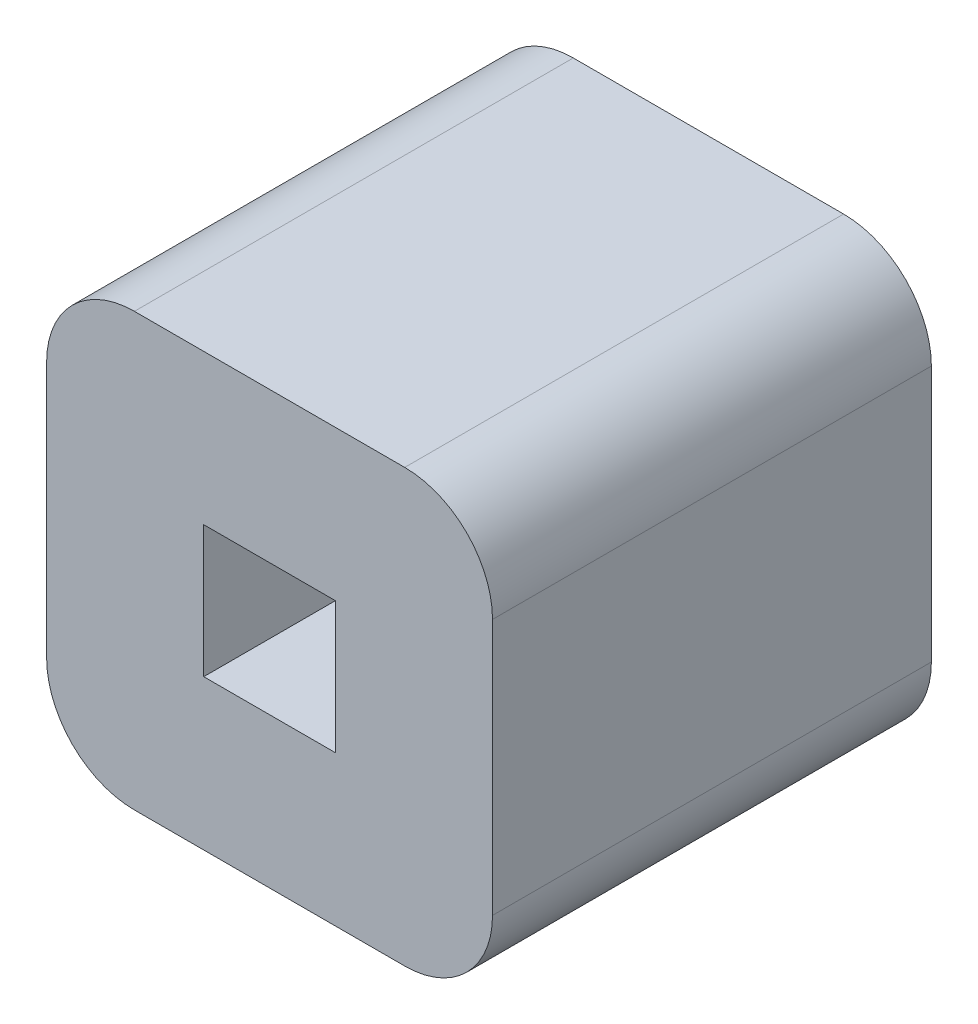
ISO-10303-21;
HEADER;
FILE_DESCRIPTION(('STEP AP214'),'2;1');
FILE_NAME('part.step','',(''),(''),'','','');
FILE_SCHEMA(('AUTOMOTIVE_DESIGN { 1 0 10303 214 1 1 1 1 }'));
ENDSEC;
DATA;
#1=APPLICATION_CONTEXT('core data for automotive mechanical design processes');
#2=APPLICATION_PROTOCOL_DEFINITION('international standard','automotive_design',2000,#1);
#3=PRODUCT_CONTEXT('',#1,'mechanical');
#4=PRODUCT('Part','Part','',(#3));
#5=PRODUCT_RELATED_PRODUCT_CATEGORY('part','',(#4));
#6=PRODUCT_DEFINITION_FORMATION('','',#4);
#7=PRODUCT_DEFINITION_CONTEXT('part definition',#1,'design');
#8=PRODUCT_DEFINITION('design','',#6,#7);
#9=PRODUCT_DEFINITION_SHAPE('','',#8);
#10=(LENGTH_UNIT() NAMED_UNIT(*) SI_UNIT(.MILLI.,.METRE.));
#11=(NAMED_UNIT(*) PLANE_ANGLE_UNIT() SI_UNIT($,.RADIAN.));
#12=(NAMED_UNIT(*) SI_UNIT($,.STERADIAN.) SOLID_ANGLE_UNIT());
#13=UNCERTAINTY_MEASURE_WITH_UNIT(LENGTH_MEASURE(1.E-05),#10,'distance_accuracy_value','');
#14=(GEOMETRIC_REPRESENTATION_CONTEXT(3) GLOBAL_UNCERTAINTY_ASSIGNED_CONTEXT((#13)) GLOBAL_UNIT_ASSIGNED_CONTEXT((#10,
#11,#12)) REPRESENTATION_CONTEXT('',''));
#15=CARTESIAN_POINT('',(0.,0.,0.));
#16=DIRECTION('',(0.,0.,1.));
#17=DIRECTION('',(1.,0.,0.));
#18=AXIS2_PLACEMENT_3D('',#15,#16,#17);
#19=CARTESIAN_POINT('',(0.960735714690616,-1.07588735959036,0.0649535433070866));
#20=DIRECTION('',(0.,0.,1.));
#21=DIRECTION('',(0.,-1.,0.));
#22=AXIS2_PLACEMENT_3D('',#19,#20,#21);
#23=PLANE('',#22);
#24=CARTESIAN_POINT('',(0.985420754060695,-0.888879485574608,0.0649535433070866));
#25=DIRECTION('',(0.,0.,1.));
#26=DIRECTION('',(0.,-1.,0.));
#27=AXIS2_PLACEMENT_3D('',#24,#25,#26);
#28=CIRCLE('',#27,0.0196850393700787);
#29=CARTESIAN_POINT('',(0.985420754060695,-0.869194446204529,0.0649535433070866));
#30=VERTEX_POINT('',#29);
#31=CARTESIAN_POINT('',(0.965735714690616,-0.888879485574608,0.0649535433070866));
#32=VERTEX_POINT('',#31);
#33=EDGE_CURVE('E131',#30,#32,#28,.T.);
#34=ORIENTED_EDGE('',*,*,#33,.F.);
#35=DIRECTION('',(1.,0.,0.));
#36=VECTOR('',#35,1.);
#37=CARTESIAN_POINT('',(0.982389257997702,-0.869194446204529,0.0649535433070866));
#38=LINE('',#37,#36);
#39=CARTESIAN_POINT('',(1.04605067532054,-0.869194446204529,0.0649535433070866));
#40=VERTEX_POINT('',#39);
#41=EDGE_CURVE('E128',#30,#40,#38,.T.);
#42=ORIENTED_EDGE('',*,*,#41,.T.);
#43=CARTESIAN_POINT('',(1.04605067532054,-0.888879485574608,0.0649535433070866));
#44=DIRECTION('',(0.,0.,1.));
#45=DIRECTION('',(0.,-1.,0.));
#46=AXIS2_PLACEMENT_3D('',#43,#44,#45);
#47=CIRCLE('',#46,0.0196850393700787);
#48=CARTESIAN_POINT('',(1.06573571469062,-0.888879485574608,0.0649535433070866));
#49=VERTEX_POINT('',#48);
#50=EDGE_CURVE('E139',#49,#40,#47,.T.);
#51=ORIENTED_EDGE('',*,*,#50,.F.);
#52=DIRECTION('',(0.,1.,0.));
#53=VECTOR('',#52,1.);
#54=CARTESIAN_POINT('',(1.06573571469062,-0.917619643054922,0.0649535433070866));
#55=LINE('',#54,#53);
#56=CARTESIAN_POINT('',(1.06573571469062,-0.946359800535237,0.0649535433070866));
#57=VERTEX_POINT('',#56);
#58=EDGE_CURVE('E136',#57,#49,#55,.T.);
#59=ORIENTED_EDGE('',*,*,#58,.F.);
#60=CARTESIAN_POINT('',(1.04605067532054,-0.946359800535237,0.0649535433070866));
#61=DIRECTION('',(0.,0.,-1.));
#62=DIRECTION('',(0.,1.,0.));
#63=AXIS2_PLACEMENT_3D('',#60,#61,#62);
#64=CIRCLE('',#63,0.0196850393700787);
#65=CARTESIAN_POINT('',(1.04605067532054,-0.966044839905316,0.0649535433070866));
#66=VERTEX_POINT('',#65);
#67=EDGE_CURVE('E162',#66,#57,#64,.F.);
#68=ORIENTED_EDGE('',*,*,#67,.F.);
#69=DIRECTION('',(1.,0.,0.));
#70=VECTOR('',#69,1.);
#71=CARTESIAN_POINT('',(0.982389257997702,-0.966044839905316,0.0649535433070866));
#72=LINE('',#71,#70);
#73=CARTESIAN_POINT('',(0.985420754060695,-0.966044839905316,0.0649535433070866));
#74=VERTEX_POINT('',#73);
#75=EDGE_CURVE('E141',#74,#66,#72,.T.);
#76=ORIENTED_EDGE('',*,*,#75,.F.);
#77=CARTESIAN_POINT('',(0.985420754060695,-0.946359800535237,0.0649535433070866));
#78=DIRECTION('',(0.,0.,-1.));
#79=DIRECTION('',(0.,1.,0.));
#80=AXIS2_PLACEMENT_3D('',#77,#78,#79);
#81=CIRCLE('',#80,0.0196850393700787);
#82=CARTESIAN_POINT('',(0.965735714690616,-0.946359800535237,0.0649535433070866));
#83=VERTEX_POINT('',#82);
#84=EDGE_CURVE('E20',#83,#74,#81,.F.);
#85=ORIENTED_EDGE('',*,*,#84,.F.);
#86=DIRECTION('',(0.,-1.,0.));
#87=VECTOR('',#86,1.);
#88=CARTESIAN_POINT('',(0.965735714690616,-0.917619643054922,0.0649535433070866));
#89=LINE('',#88,#87);
#90=EDGE_CURVE('E133',#32,#83,#89,.T.);
#91=ORIENTED_EDGE('',*,*,#90,.F.);
#92=EDGE_LOOP('',(#34,#42,#51,#59,#68,#76,#85,#91));
#93=FACE_BOUND('',#92,.T.);
#94=DIRECTION('',(0.,-1.,0.));
#95=VECTOR('',#94,1.);
#96=CARTESIAN_POINT('',(1.00097193516306,-0.901379485574607,0.0649535433070866));
#97=LINE('',#96,#95);
#98=CARTESIAN_POINT('',(1.00097193516306,-0.902855863527363,0.0649535433070866));
#99=VERTEX_POINT('',#98);
#100=CARTESIAN_POINT('',(1.00097193516306,-0.932383422582481,0.0649535433070866));
#101=VERTEX_POINT('',#100);
#102=EDGE_CURVE('E135',#99,#101,#97,.T.);
#103=ORIENTED_EDGE('',*,*,#102,.T.);
#104=DIRECTION('',(1.,0.,0.));
#105=VECTOR('',#104,1.);
#106=CARTESIAN_POINT('',(1.03197587217093,-0.932383422582481,0.0649535433070866));
#107=LINE('',#106,#105);
#108=CARTESIAN_POINT('',(1.03049949421818,-0.932383422582481,0.0649535433070866));
#109=VERTEX_POINT('',#108);
#110=EDGE_CURVE('E103',#109,#101,#107,.F.);
#111=ORIENTED_EDGE('',*,*,#110,.F.);
#112=DIRECTION('',(0.,1.,0.));
#113=VECTOR('',#112,1.);
#114=CARTESIAN_POINT('',(1.03049949421818,-0.933859800535237,0.0649535433070866));
#115=LINE('',#114,#113);
#116=CARTESIAN_POINT('',(1.03049949421818,-0.902855863527363,0.0649535433070866));
#117=VERTEX_POINT('',#116);
#118=EDGE_CURVE('E116',#109,#117,#115,.T.);
#119=ORIENTED_EDGE('',*,*,#118,.T.);
#120=DIRECTION('',(1.,0.,0.));
#121=VECTOR('',#120,1.);
#122=CARTESIAN_POINT('',(1.03197587217093,-0.902855863527363,0.0649535433070866));
#123=LINE('',#122,#121);
#124=EDGE_CURVE('E94',#117,#99,#123,.F.);
#125=ORIENTED_EDGE('',*,*,#124,.T.);
#126=EDGE_LOOP('',(#103,#111,#119,#125));
#127=FACE_BOUND('',#126,.T.);
#128=ADVANCED_FACE('F17',(#93,#127),#23,.F.);
#129=CARTESIAN_POINT('',(1.03197587217093,-0.902855863527363,0.152158267716535));
#130=DIRECTION('',(0.,1.,0.));
#131=DIRECTION('',(0.,0.,1.));
#132=AXIS2_PLACEMENT_3D('',#129,#130,#131);
#133=PLANE('',#132);
#134=DIRECTION('',(0.,0.,1.));
#135=VECTOR('',#134,1.);
#136=CARTESIAN_POINT('',(1.03049949421818,-0.902855863527363,0.152158267716535));
#137=LINE('',#136,#135);
#138=CARTESIAN_POINT('',(1.03049949421818,-0.902855863527363,0.16337874015748));
#139=VERTEX_POINT('',#138);
#140=EDGE_CURVE('E110',#117,#139,#137,.T.);
#141=ORIENTED_EDGE('',*,*,#140,.T.);
#142=DIRECTION('',(1.,0.,0.));
#143=VECTOR('',#142,1.);
#144=CARTESIAN_POINT('',(0.960735714690616,-0.902855863527363,0.16337874015748));
#145=LINE('',#144,#143);
#146=CARTESIAN_POINT('',(1.00097193516306,-0.902855863527363,0.16337874015748));
#147=VERTEX_POINT('',#146);
#148=EDGE_CURVE('E199',#147,#139,#145,.T.);
#149=ORIENTED_EDGE('',*,*,#148,.F.);
#150=DIRECTION('',(0.,0.,1.));
#151=VECTOR('',#150,1.);
#152=CARTESIAN_POINT('',(1.00097193516306,-0.902855863527363,0.152158267716535));
#153=LINE('',#152,#151);
#154=EDGE_CURVE('E113',#147,#99,#153,.F.);
#155=ORIENTED_EDGE('',*,*,#154,.T.);
#156=ORIENTED_EDGE('',*,*,#124,.F.);
#157=EDGE_LOOP('',(#141,#149,#155,#156));
#158=FACE_BOUND('',#157,.T.);
#159=ADVANCED_FACE('F107',(#158),#133,.F.);
#160=CARTESIAN_POINT('',(1.03049949421818,-0.933859800535237,0.152158267716535));
#161=DIRECTION('',(1.,0.,0.));
#162=DIRECTION('',(0.,1.,0.));
#163=AXIS2_PLACEMENT_3D('',#160,#161,#162);
#164=PLANE('',#163);
#165=DIRECTION('',(0.,0.,1.));
#166=VECTOR('',#165,1.);
#167=CARTESIAN_POINT('',(1.03049949421818,-0.932383422582481,0.152158267716535));
#168=LINE('',#167,#166);
#169=CARTESIAN_POINT('',(1.03049949421818,-0.932383422582481,0.16337874015748));
#170=VERTEX_POINT('',#169);
#171=EDGE_CURVE('E181',#170,#109,#168,.F.);
#172=ORIENTED_EDGE('',*,*,#171,.F.);
#173=DIRECTION('',(0.,-1.,0.));
#174=VECTOR('',#173,1.);
#175=CARTESIAN_POINT('',(1.03049949421818,-1.07588735959036,0.16337874015748));
#176=LINE('',#175,#174);
#177=EDGE_CURVE('E123',#139,#170,#176,.T.);
#178=ORIENTED_EDGE('',*,*,#177,.F.);
#179=ORIENTED_EDGE('',*,*,#140,.F.);
#180=ORIENTED_EDGE('',*,*,#118,.F.);
#181=EDGE_LOOP('',(#172,#178,#179,#180));
#182=FACE_BOUND('',#181,.T.);
#183=ADVANCED_FACE('F121',(#182),#164,.F.);
#184=CARTESIAN_POINT('',(1.03197587217093,-0.932383422582481,0.152158267716535));
#185=DIRECTION('',(0.,1.,0.));
#186=DIRECTION('',(0.,0.,1.));
#187=AXIS2_PLACEMENT_3D('',#184,#185,#186);
#188=PLANE('',#187);
#189=DIRECTION('',(1.,0.,0.));
#190=VECTOR('',#189,1.);
#191=CARTESIAN_POINT('',(0.960735714690616,-0.932383422582481,0.16337874015748));
#192=LINE('',#191,#190);
#193=CARTESIAN_POINT('',(1.00097193516306,-0.932383422582481,0.16337874015748));
#194=VERTEX_POINT('',#193);
#195=EDGE_CURVE('E195',#170,#194,#192,.F.);
#196=ORIENTED_EDGE('',*,*,#195,.F.);
#197=ORIENTED_EDGE('',*,*,#171,.T.);
#198=ORIENTED_EDGE('',*,*,#110,.T.);
#199=DIRECTION('',(0.,0.,1.));
#200=VECTOR('',#199,1.);
#201=CARTESIAN_POINT('',(1.00097193516306,-0.932383422582481,0.152158267716535));
#202=LINE('',#201,#200);
#203=EDGE_CURVE('E178',#101,#194,#202,.T.);
#204=ORIENTED_EDGE('',*,*,#203,.T.);
#205=EDGE_LOOP('',(#196,#197,#198,#204));
#206=FACE_BOUND('',#205,.T.);
#207=ADVANCED_FACE('F184',(#206),#188,.T.);
#208=CARTESIAN_POINT('',(1.00097193516306,-0.901379485574607,0.152158267716535));
#209=DIRECTION('',(-1.,0.,0.));
#210=DIRECTION('',(0.,-1.,0.));
#211=AXIS2_PLACEMENT_3D('',#208,#209,#210);
#212=PLANE('',#211);
#213=ORIENTED_EDGE('',*,*,#154,.F.);
#214=DIRECTION('',(0.,-1.,0.));
#215=VECTOR('',#214,1.);
#216=CARTESIAN_POINT('',(1.00097193516306,-1.07588735959036,0.16337874015748));
#217=LINE('',#216,#215);
#218=EDGE_CURVE('E190',#194,#147,#217,.F.);
#219=ORIENTED_EDGE('',*,*,#218,.F.);
#220=ORIENTED_EDGE('',*,*,#203,.F.);
#221=ORIENTED_EDGE('',*,*,#102,.F.);
#222=EDGE_LOOP('',(#213,#219,#220,#221));
#223=FACE_BOUND('',#222,.T.);
#224=ADVANCED_FACE('F188',(#223),#212,.F.);
#225=CARTESIAN_POINT('',(0.965735714690616,-0.917619643054922,0.114166141732283));
#226=DIRECTION('',(-1.,0.,0.));
#227=DIRECTION('',(0.,-1.,0.));
#228=AXIS2_PLACEMENT_3D('',#225,#226,#227);
#229=PLANE('',#228);
#230=DIRECTION('',(0.,-1.,0.));
#231=VECTOR('',#230,1.);
#232=CARTESIAN_POINT('',(0.965735714690616,-1.07588735959036,0.16337874015748));
#233=LINE('',#232,#231);
#234=CARTESIAN_POINT('',(0.965735714690616,-0.888879485574608,0.16337874015748));
#235=VERTEX_POINT('',#234);
#236=CARTESIAN_POINT('',(0.965735714690616,-0.946359800535237,0.16337874015748));
#237=VERTEX_POINT('',#236);
#238=EDGE_CURVE('E157',#235,#237,#233,.T.);
#239=ORIENTED_EDGE('',*,*,#238,.F.);
#240=DIRECTION('',(0.,0.,1.));
#241=VECTOR('',#240,1.);
#242=CARTESIAN_POINT('',(0.965735714690616,-0.888879485574608,0.1683));
#243=LINE('',#242,#241);
#244=EDGE_CURVE('E160',#32,#235,#243,.T.);
#245=ORIENTED_EDGE('',*,*,#244,.F.);
#246=ORIENTED_EDGE('',*,*,#90,.T.);
#247=DIRECTION('',(0.,0.,-1.));
#248=VECTOR('',#247,1.);
#249=CARTESIAN_POINT('',(0.965735714690616,-0.946359800535237,0.1683));
#250=LINE('',#249,#248);
#251=EDGE_CURVE('E144',#237,#83,#250,.T.);
#252=ORIENTED_EDGE('',*,*,#251,.F.);
#253=EDGE_LOOP('',(#239,#245,#246,#252));
#254=FACE_BOUND('',#253,.T.);
#255=ADVANCED_FACE('F226',(#254),#229,.T.);
#256=CARTESIAN_POINT('',(0.985420754060695,-0.946359800535237,0.1683));
#257=DIRECTION('',(0.,0.,-1.));
#258=DIRECTION('',(0.,1.,0.));
#259=AXIS2_PLACEMENT_3D('',#256,#257,#258);
#260=CYLINDRICAL_SURFACE('',#259,0.0196850393700787);
#261=CARTESIAN_POINT('',(0.985420754060695,-0.946359800535237,0.16337874015748));
#262=DIRECTION('',(0.,0.,-1.));
#263=DIRECTION('',(0.,1.,0.));
#264=AXIS2_PLACEMENT_3D('',#261,#262,#263);
#265=CIRCLE('',#264,0.0196850393700787);
#266=CARTESIAN_POINT('',(0.985420754060695,-0.966044839905316,0.16337874015748));
#267=VERTEX_POINT('',#266);
#268=EDGE_CURVE('E154',#237,#267,#265,.F.);
#269=ORIENTED_EDGE('',*,*,#268,.F.);
#270=ORIENTED_EDGE('',*,*,#251,.T.);
#271=ORIENTED_EDGE('',*,*,#84,.T.);
#272=DIRECTION('',(0.,0.,-1.));
#273=VECTOR('',#272,1.);
#274=CARTESIAN_POINT('',(0.985420754060695,-0.966044839905316,0.0600322834645669));
#275=LINE('',#274,#273);
#276=EDGE_CURVE('E143',#267,#74,#275,.T.);
#277=ORIENTED_EDGE('',*,*,#276,.F.);
#278=EDGE_LOOP('',(#269,#270,#271,#277));
#279=FACE_BOUND('',#278,.T.);
#280=ADVANCED_FACE('F236',(#279),#260,.T.);
#281=CARTESIAN_POINT('',(0.982389257997702,-0.966044839905316,0.0600322834645669));
#282=DIRECTION('',(0.,-1.,0.));
#283=DIRECTION('',(0.,0.,-1.));
#284=AXIS2_PLACEMENT_3D('',#281,#282,#283);
#285=PLANE('',#284);
#286=DIRECTION('',(1.,0.,0.));
#287=VECTOR('',#286,1.);
#288=CARTESIAN_POINT('',(0.960735714690616,-0.966044839905316,0.16337874015748));
#289=LINE('',#288,#287);
#290=CARTESIAN_POINT('',(1.04605067532054,-0.966044839905316,0.16337874015748));
#291=VERTEX_POINT('',#290);
#292=EDGE_CURVE('E153',#267,#291,#289,.T.);
#293=ORIENTED_EDGE('',*,*,#292,.F.);
#294=ORIENTED_EDGE('',*,*,#276,.T.);
#295=ORIENTED_EDGE('',*,*,#75,.T.);
#296=DIRECTION('',(0.,0.,-1.));
#297=VECTOR('',#296,1.);
#298=CARTESIAN_POINT('',(1.04605067532054,-0.966044839905316,0.1683));
#299=LINE('',#298,#297);
#300=EDGE_CURVE('E163',#291,#66,#299,.T.);
#301=ORIENTED_EDGE('',*,*,#300,.F.);
#302=EDGE_LOOP('',(#293,#294,#295,#301));
#303=FACE_BOUND('',#302,.T.);
#304=ADVANCED_FACE('F234',(#303),#285,.T.);
#305=CARTESIAN_POINT('',(1.04605067532054,-0.946359800535237,0.1683));
#306=DIRECTION('',(0.,0.,-1.));
#307=DIRECTION('',(0.,1.,0.));
#308=AXIS2_PLACEMENT_3D('',#305,#306,#307);
#309=CYLINDRICAL_SURFACE('',#308,0.0196850393700787);
#310=CARTESIAN_POINT('',(1.04605067532054,-0.946359800535237,0.16337874015748));
#311=DIRECTION('',(0.,0.,-1.));
#312=DIRECTION('',(0.,1.,0.));
#313=AXIS2_PLACEMENT_3D('',#310,#311,#312);
#314=CIRCLE('',#313,0.0196850393700787);
#315=CARTESIAN_POINT('',(1.06573571469062,-0.946359800535237,0.16337874015748));
#316=VERTEX_POINT('',#315);
#317=EDGE_CURVE('E150',#291,#316,#314,.F.);
#318=ORIENTED_EDGE('',*,*,#317,.F.);
#319=ORIENTED_EDGE('',*,*,#300,.T.);
#320=ORIENTED_EDGE('',*,*,#67,.T.);
#321=DIRECTION('',(0.,0.,1.));
#322=VECTOR('',#321,1.);
#323=CARTESIAN_POINT('',(1.06573571469062,-0.946359800535237,0.114166141732283));
#324=LINE('',#323,#322);
#325=EDGE_CURVE('E140',#316,#57,#324,.F.);
#326=ORIENTED_EDGE('',*,*,#325,.F.);
#327=EDGE_LOOP('',(#318,#319,#320,#326));
#328=FACE_BOUND('',#327,.T.);
#329=ADVANCED_FACE('F215',(#328),#309,.T.);
#330=CARTESIAN_POINT('',(1.06573571469062,-0.917619643054922,0.114166141732283));
#331=DIRECTION('',(1.,0.,0.));
#332=DIRECTION('',(0.,1.,0.));
#333=AXIS2_PLACEMENT_3D('',#330,#331,#332);
#334=PLANE('',#333);
#335=ORIENTED_EDGE('',*,*,#325,.T.);
#336=ORIENTED_EDGE('',*,*,#58,.T.);
#337=DIRECTION('',(0.,0.,1.));
#338=VECTOR('',#337,1.);
#339=CARTESIAN_POINT('',(1.06573571469062,-0.888879485574608,0.1683));
#340=LINE('',#339,#338);
#341=CARTESIAN_POINT('',(1.06573571469062,-0.888879485574608,0.16337874015748));
#342=VERTEX_POINT('',#341);
#343=EDGE_CURVE('E161',#342,#49,#340,.F.);
#344=ORIENTED_EDGE('',*,*,#343,.F.);
#345=DIRECTION('',(0.,-1.,0.));
#346=VECTOR('',#345,1.);
#347=CARTESIAN_POINT('',(1.06573571469062,-1.07588735959036,0.16337874015748));
#348=LINE('',#347,#346);
#349=EDGE_CURVE('E149',#316,#342,#348,.F.);
#350=ORIENTED_EDGE('',*,*,#349,.F.);
#351=EDGE_LOOP('',(#335,#336,#344,#350));
#352=FACE_BOUND('',#351,.T.);
#353=ADVANCED_FACE('F212',(#352),#334,.T.);
#354=CARTESIAN_POINT('',(1.04605067532054,-0.888879485574608,0.1683));
#355=DIRECTION('',(0.,0.,1.));
#356=DIRECTION('',(0.,-1.,0.));
#357=AXIS2_PLACEMENT_3D('',#354,#355,#356);
#358=CYLINDRICAL_SURFACE('',#357,0.0196850393700787);
#359=CARTESIAN_POINT('',(1.04605067532054,-0.888879485574608,0.16337874015748));
#360=DIRECTION('',(0.,0.,1.));
#361=DIRECTION('',(0.,-1.,0.));
#362=AXIS2_PLACEMENT_3D('',#359,#360,#361);
#363=CIRCLE('',#362,0.0196850393700787);
#364=CARTESIAN_POINT('',(1.04605067532054,-0.869194446204529,0.16337874015748));
#365=VERTEX_POINT('',#364);
#366=EDGE_CURVE('E146',#342,#365,#363,.T.);
#367=ORIENTED_EDGE('',*,*,#366,.F.);
#368=ORIENTED_EDGE('',*,*,#343,.T.);
#369=ORIENTED_EDGE('',*,*,#50,.T.);
#370=DIRECTION('',(0.,0.,-1.));
#371=VECTOR('',#370,1.);
#372=CARTESIAN_POINT('',(1.04605067532054,-0.869194446204529,0.0600322834645669));
#373=LINE('',#372,#371);
#374=EDGE_CURVE('E132',#40,#365,#373,.F.);
#375=ORIENTED_EDGE('',*,*,#374,.T.);
#376=EDGE_LOOP('',(#367,#368,#369,#375));
#377=FACE_BOUND('',#376,.T.);
#378=ADVANCED_FACE('F233',(#377),#358,.T.);
#379=CARTESIAN_POINT('',(0.982389257997702,-0.869194446204529,0.0600322834645669));
#380=DIRECTION('',(0.,-1.,0.));
#381=DIRECTION('',(0.,0.,-1.));
#382=AXIS2_PLACEMENT_3D('',#379,#380,#381);
#383=PLANE('',#382);
#384=DIRECTION('',(0.,0.,1.));
#385=VECTOR('',#384,1.);
#386=CARTESIAN_POINT('',(0.985420754060695,-0.869194446204529,0.1683));
#387=LINE('',#386,#385);
#388=CARTESIAN_POINT('',(0.985420754060695,-0.869194446204529,0.16337874015748));
#389=VERTEX_POINT('',#388);
#390=EDGE_CURVE('E35',#389,#30,#387,.F.);
#391=ORIENTED_EDGE('',*,*,#390,.F.);
#392=DIRECTION('',(1.,0.,0.));
#393=VECTOR('',#392,1.);
#394=CARTESIAN_POINT('',(0.960735714690616,-0.869194446204529,0.16337874015748));
#395=LINE('',#394,#393);
#396=EDGE_CURVE('E26',#365,#389,#395,.F.);
#397=ORIENTED_EDGE('',*,*,#396,.F.);
#398=ORIENTED_EDGE('',*,*,#374,.F.);
#399=ORIENTED_EDGE('',*,*,#41,.F.);
#400=EDGE_LOOP('',(#391,#397,#398,#399));
#401=FACE_BOUND('',#400,.T.);
#402=ADVANCED_FACE('F230',(#401),#383,.F.);
#403=CARTESIAN_POINT('',(0.985420754060695,-0.888879485574608,0.1683));
#404=DIRECTION('',(0.,0.,1.));
#405=DIRECTION('',(0.,-1.,0.));
#406=AXIS2_PLACEMENT_3D('',#403,#404,#405);
#407=CYLINDRICAL_SURFACE('',#406,0.0196850393700787);
#408=CARTESIAN_POINT('',(0.985420754060695,-0.888879485574608,0.16337874015748));
#409=DIRECTION('',(0.,0.,1.));
#410=DIRECTION('',(0.,-1.,0.));
#411=AXIS2_PLACEMENT_3D('',#408,#409,#410);
#412=CIRCLE('',#411,0.0196850393700787);
#413=EDGE_CURVE('E11',#389,#235,#412,.T.);
#414=ORIENTED_EDGE('',*,*,#413,.F.);
#415=ORIENTED_EDGE('',*,*,#390,.T.);
#416=ORIENTED_EDGE('',*,*,#33,.T.);
#417=ORIENTED_EDGE('',*,*,#244,.T.);
#418=EDGE_LOOP('',(#414,#415,#416,#417));
#419=FACE_BOUND('',#418,.T.);
#420=ADVANCED_FACE('F228',(#419),#407,.T.);
#421=CARTESIAN_POINT('',(0.960735714690616,-1.07588735959036,0.16337874015748));
#422=DIRECTION('',(0.,0.,1.));
#423=DIRECTION('',(0.,-1.,0.));
#424=AXIS2_PLACEMENT_3D('',#421,#422,#423);
#425=PLANE('',#424);
#426=ORIENTED_EDGE('',*,*,#396,.T.);
#427=ORIENTED_EDGE('',*,*,#413,.T.);
#428=ORIENTED_EDGE('',*,*,#238,.T.);
#429=ORIENTED_EDGE('',*,*,#268,.T.);
#430=ORIENTED_EDGE('',*,*,#292,.T.);
#431=ORIENTED_EDGE('',*,*,#317,.T.);
#432=ORIENTED_EDGE('',*,*,#349,.T.);
#433=ORIENTED_EDGE('',*,*,#366,.T.);
#434=EDGE_LOOP('',(#426,#427,#428,#429,#430,#431,#432,#433));
#435=FACE_BOUND('',#434,.T.);
#436=ORIENTED_EDGE('',*,*,#195,.T.);
#437=ORIENTED_EDGE('',*,*,#218,.T.);
#438=ORIENTED_EDGE('',*,*,#148,.T.);
#439=ORIENTED_EDGE('',*,*,#177,.T.);
#440=EDGE_LOOP('',(#436,#437,#438,#439));
#441=FACE_BOUND('',#440,.T.);
#442=ADVANCED_FACE('F197',(#435,#441),#425,.T.);
#443=CLOSED_SHELL('',(#128,#159,#183,#207,#224,#255,#280,#304,#329,#353,#378,#402,#420,#442));
#444=MANIFOLD_SOLID_BREP('B1',#443);
#445=ADVANCED_BREP_SHAPE_REPRESENTATION('',(#18,#444),#14);
#446=SHAPE_DEFINITION_REPRESENTATION(#9,#445);
ENDSEC;
END-ISO-10303-21;
